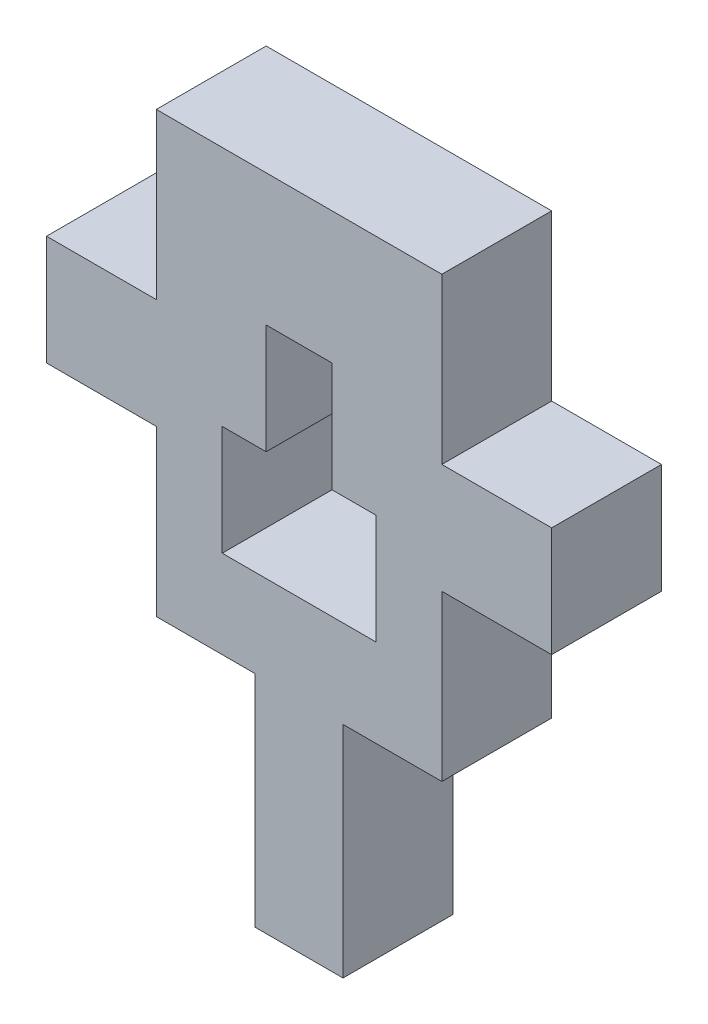
ISO-10303-21;
HEADER;
FILE_DESCRIPTION(('STEP AP214'),'2;1');
FILE_NAME('part.step','',(''),(''),'','','');
FILE_SCHEMA(('AUTOMOTIVE_DESIGN { 1 0 10303 214 1 1 1 1 }'));
ENDSEC;
DATA;
#1=APPLICATION_CONTEXT('core data for automotive mechanical design processes');
#2=APPLICATION_PROTOCOL_DEFINITION('international standard','automotive_design',2000,#1);
#3=PRODUCT_CONTEXT('',#1,'mechanical');
#4=PRODUCT('Part','Part','',(#3));
#5=PRODUCT_RELATED_PRODUCT_CATEGORY('part','',(#4));
#6=PRODUCT_DEFINITION_FORMATION('','',#4);
#7=PRODUCT_DEFINITION_CONTEXT('part definition',#1,'design');
#8=PRODUCT_DEFINITION('design','',#6,#7);
#9=PRODUCT_DEFINITION_SHAPE('','',#8);
#10=(LENGTH_UNIT() NAMED_UNIT(*) SI_UNIT(.MILLI.,.METRE.));
#11=(NAMED_UNIT(*) PLANE_ANGLE_UNIT() SI_UNIT($,.RADIAN.));
#12=(NAMED_UNIT(*) SI_UNIT($,.STERADIAN.) SOLID_ANGLE_UNIT());
#13=UNCERTAINTY_MEASURE_WITH_UNIT(LENGTH_MEASURE(1.E-05),#10,'distance_accuracy_value','');
#14=(GEOMETRIC_REPRESENTATION_CONTEXT(3) GLOBAL_UNCERTAINTY_ASSIGNED_CONTEXT((#13)) GLOBAL_UNIT_ASSIGNED_CONTEXT((#10,
#11,#12)) REPRESENTATION_CONTEXT('',''));
#15=CARTESIAN_POINT('',(0.,0.,0.));
#16=DIRECTION('',(0.,0.,1.));
#17=DIRECTION('',(1.,0.,0.));
#18=AXIS2_PLACEMENT_3D('',#15,#16,#17);
#19=CARTESIAN_POINT('',(10.,9.,10.));
#20=DIRECTION('',(0.,1.,0.));
#21=DIRECTION('',(0.,0.,1.));
#22=AXIS2_PLACEMENT_3D('',#19,#20,#21);
#23=PLANE('',#22);
#24=DIRECTION('',(-1.,0.,0.));
#25=VECTOR('',#24,1.);
#26=CARTESIAN_POINT('',(0.,9.,5.));
#27=LINE('',#26,#25);
#28=CARTESIAN_POINT('',(10.,9.,5.));
#29=VERTEX_POINT('',#28);
#30=CARTESIAN_POINT('',(8.,9.,5.));
#31=VERTEX_POINT('',#30);
#32=EDGE_CURVE('E253',#29,#31,#27,.T.);
#33=ORIENTED_EDGE('',*,*,#32,.T.);
#34=DIRECTION('',(0.,0.,-1.));
#35=VECTOR('',#34,1.);
#36=CARTESIAN_POINT('',(8.,9.,10.));
#37=LINE('',#36,#35);
#38=CARTESIAN_POINT('',(8.,9.,0.));
#39=VERTEX_POINT('',#38);
#40=EDGE_CURVE('E223',#31,#39,#37,.T.);
#41=ORIENTED_EDGE('',*,*,#40,.T.);
#42=DIRECTION('',(1.,0.,0.));
#43=VECTOR('',#42,1.);
#44=CARTESIAN_POINT('',(10.,9.,0.));
#45=LINE('',#44,#43);
#46=CARTESIAN_POINT('',(10.,9.,0.));
#47=VERTEX_POINT('',#46);
#48=EDGE_CURVE('E236',#39,#47,#45,.T.);
#49=ORIENTED_EDGE('',*,*,#48,.T.);
#50=DIRECTION('',(0.,0.,-1.));
#51=VECTOR('',#50,1.);
#52=CARTESIAN_POINT('',(10.,9.,10.));
#53=LINE('',#52,#51);
#54=EDGE_CURVE('E240',#29,#47,#53,.T.);
#55=ORIENTED_EDGE('',*,*,#54,.F.);
#56=EDGE_LOOP('',(#33,#41,#49,#55));
#57=FACE_BOUND('',#56,.T.);
#58=ADVANCED_FACE('F34',(#57),#23,.F.);
#59=CARTESIAN_POINT('',(8.5,0.,5.));
#60=DIRECTION('',(1.,0.,0.));
#61=DIRECTION('',(0.,0.,-1.));
#62=AXIS2_PLACEMENT_3D('',#59,#60,#61);
#63=PLANE('',#62);
#64=DIRECTION('',(0.,-1.,0.));
#65=VECTOR('',#64,1.);
#66=CARTESIAN_POINT('',(8.5,0.,0.));
#67=LINE('',#66,#65);
#68=CARTESIAN_POINT('',(8.5,0.,0.));
#69=VERTEX_POINT('',#68);
#70=CARTESIAN_POINT('',(8.5,-10.,0.));
#71=VERTEX_POINT('',#70);
#72=EDGE_CURVE('E258',#69,#71,#67,.T.);
#73=ORIENTED_EDGE('',*,*,#72,.F.);
#74=DIRECTION('',(0.,0.,-1.));
#75=VECTOR('',#74,1.);
#76=CARTESIAN_POINT('',(8.5,0.,5.));
#77=LINE('',#76,#75);
#78=CARTESIAN_POINT('',(8.5,0.,5.));
#79=VERTEX_POINT('',#78);
#80=EDGE_CURVE('E11',#79,#69,#77,.T.);
#81=ORIENTED_EDGE('',*,*,#80,.F.);
#82=DIRECTION('',(0.,-1.,0.));
#83=VECTOR('',#82,1.);
#84=CARTESIAN_POINT('',(8.5,0.,5.));
#85=LINE('',#84,#83);
#86=CARTESIAN_POINT('',(8.5,-10.,5.));
#87=VERTEX_POINT('',#86);
#88=EDGE_CURVE('E259',#79,#87,#85,.T.);
#89=ORIENTED_EDGE('',*,*,#88,.T.);
#90=DIRECTION('',(0.,0.,-1.));
#91=VECTOR('',#90,1.);
#92=CARTESIAN_POINT('',(8.5,-10.,5.));
#93=LINE('',#92,#91);
#94=EDGE_CURVE('E294',#87,#71,#93,.T.);
#95=ORIENTED_EDGE('',*,*,#94,.T.);
#96=EDGE_LOOP('',(#73,#81,#89,#95));
#97=FACE_BOUND('',#96,.T.);
#98=ADVANCED_FACE('F36',(#97),#63,.T.);
#99=CARTESIAN_POINT('',(0.,0.,5.));
#100=DIRECTION('',(0.,1.,0.));
#101=DIRECTION('',(0.,0.,1.));
#102=AXIS2_PLACEMENT_3D('',#99,#100,#101);
#103=PLANE('',#102);
#104=DIRECTION('',(1.,0.,0.));
#105=VECTOR('',#104,1.);
#106=CARTESIAN_POINT('',(0.,0.,0.));
#107=LINE('',#106,#105);
#108=CARTESIAN_POINT('',(13.,0.,0.));
#109=VERTEX_POINT('',#108);
#110=EDGE_CURVE('E297',#69,#109,#107,.T.);
#111=ORIENTED_EDGE('',*,*,#110,.T.);
#112=DIRECTION('',(0.,0.,-1.));
#113=VECTOR('',#112,1.);
#114=CARTESIAN_POINT('',(13.,0.,5.));
#115=LINE('',#114,#113);
#116=CARTESIAN_POINT('',(13.,0.,5.));
#117=VERTEX_POINT('',#116);
#118=EDGE_CURVE('E42',#117,#109,#115,.T.);
#119=ORIENTED_EDGE('',*,*,#118,.F.);
#120=DIRECTION('',(1.,0.,0.));
#121=VECTOR('',#120,1.);
#122=CARTESIAN_POINT('',(0.,0.,5.));
#123=LINE('',#122,#121);
#124=EDGE_CURVE('E262',#79,#117,#123,.T.);
#125=ORIENTED_EDGE('',*,*,#124,.F.);
#126=ORIENTED_EDGE('',*,*,#80,.T.);
#127=EDGE_LOOP('',(#111,#119,#125,#126));
#128=FACE_BOUND('',#127,.T.);
#129=ADVANCED_FACE('F386',(#128),#103,.F.);
#130=CARTESIAN_POINT('',(13.,0.,5.));
#131=DIRECTION('',(-1.,0.,0.));
#132=DIRECTION('',(0.,0.,1.));
#133=AXIS2_PLACEMENT_3D('',#130,#131,#132);
#134=PLANE('',#133);
#135=DIRECTION('',(0.,1.,0.));
#136=VECTOR('',#135,1.);
#137=CARTESIAN_POINT('',(13.,0.,0.));
#138=LINE('',#137,#136);
#139=CARTESIAN_POINT('',(13.,7.5,0.));
#140=VERTEX_POINT('',#139);
#141=EDGE_CURVE('E299',#109,#140,#138,.T.);
#142=ORIENTED_EDGE('',*,*,#141,.T.);
#143=DIRECTION('',(0.,0.,-1.));
#144=VECTOR('',#143,1.);
#145=CARTESIAN_POINT('',(13.,7.5,5.));
#146=LINE('',#145,#144);
#147=CARTESIAN_POINT('',(13.,7.5,5.));
#148=VERTEX_POINT('',#147);
#149=EDGE_CURVE('E359',#148,#140,#146,.T.);
#150=ORIENTED_EDGE('',*,*,#149,.F.);
#151=DIRECTION('',(0.,1.,0.));
#152=VECTOR('',#151,1.);
#153=CARTESIAN_POINT('',(13.,0.,5.));
#154=LINE('',#153,#152);
#155=EDGE_CURVE('E265',#117,#148,#154,.T.);
#156=ORIENTED_EDGE('',*,*,#155,.F.);
#157=ORIENTED_EDGE('',*,*,#118,.T.);
#158=EDGE_LOOP('',(#142,#150,#156,#157));
#159=FACE_BOUND('',#158,.T.);
#160=ADVANCED_FACE('F366',(#159),#134,.F.);
#161=CARTESIAN_POINT('',(0.,7.5,5.));
#162=DIRECTION('',(0.,1.,0.));
#163=DIRECTION('',(0.,0.,1.));
#164=AXIS2_PLACEMENT_3D('',#161,#162,#163);
#165=PLANE('',#164);
#166=DIRECTION('',(1.,0.,0.));
#167=VECTOR('',#166,1.);
#168=CARTESIAN_POINT('',(0.,7.5,0.));
#169=LINE('',#168,#167);
#170=CARTESIAN_POINT('',(18.,7.5,0.));
#171=VERTEX_POINT('',#170);
#172=EDGE_CURVE('E302',#140,#171,#169,.T.);
#173=ORIENTED_EDGE('',*,*,#172,.T.);
#174=DIRECTION('',(0.,0.,-1.));
#175=VECTOR('',#174,1.);
#176=CARTESIAN_POINT('',(18.,7.5,5.));
#177=LINE('',#176,#175);
#178=CARTESIAN_POINT('',(18.,7.5,5.));
#179=VERTEX_POINT('',#178);
#180=EDGE_CURVE('E356',#179,#171,#177,.T.);
#181=ORIENTED_EDGE('',*,*,#180,.F.);
#182=DIRECTION('',(1.,0.,0.));
#183=VECTOR('',#182,1.);
#184=CARTESIAN_POINT('',(0.,7.5,5.));
#185=LINE('',#184,#183);
#186=EDGE_CURVE('E268',#148,#179,#185,.T.);
#187=ORIENTED_EDGE('',*,*,#186,.F.);
#188=ORIENTED_EDGE('',*,*,#149,.T.);
#189=EDGE_LOOP('',(#173,#181,#187,#188));
#190=FACE_BOUND('',#189,.T.);
#191=ADVANCED_FACE('F376',(#190),#165,.F.);
#192=CARTESIAN_POINT('',(18.,0.,5.));
#193=DIRECTION('',(-1.,0.,0.));
#194=DIRECTION('',(0.,-1.,0.));
#195=AXIS2_PLACEMENT_3D('',#192,#193,#194);
#196=PLANE('',#195);
#197=DIRECTION('',(0.,1.,0.));
#198=VECTOR('',#197,1.);
#199=CARTESIAN_POINT('',(18.,0.,0.));
#200=LINE('',#199,#198);
#201=CARTESIAN_POINT('',(18.,12.5,0.));
#202=VERTEX_POINT('',#201);
#203=EDGE_CURVE('E305',#171,#202,#200,.T.);
#204=ORIENTED_EDGE('',*,*,#203,.T.);
#205=DIRECTION('',(0.,0.,-1.));
#206=VECTOR('',#205,1.);
#207=CARTESIAN_POINT('',(18.,12.5,5.));
#208=LINE('',#207,#206);
#209=CARTESIAN_POINT('',(18.,12.5,5.));
#210=VERTEX_POINT('',#209);
#211=EDGE_CURVE('E354',#210,#202,#208,.T.);
#212=ORIENTED_EDGE('',*,*,#211,.F.);
#213=DIRECTION('',(0.,1.,0.));
#214=VECTOR('',#213,1.);
#215=CARTESIAN_POINT('',(18.,0.,5.));
#216=LINE('',#215,#214);
#217=EDGE_CURVE('E271',#179,#210,#216,.T.);
#218=ORIENTED_EDGE('',*,*,#217,.F.);
#219=ORIENTED_EDGE('',*,*,#180,.T.);
#220=EDGE_LOOP('',(#204,#212,#218,#219));
#221=FACE_BOUND('',#220,.T.);
#222=ADVANCED_FACE('F380',(#221),#196,.F.);
#223=CARTESIAN_POINT('',(0.,12.5,5.));
#224=DIRECTION('',(0.,1.,0.));
#225=DIRECTION('',(0.,0.,1.));
#226=AXIS2_PLACEMENT_3D('',#223,#224,#225);
#227=PLANE('',#226);
#228=DIRECTION('',(1.,0.,0.));
#229=VECTOR('',#228,1.);
#230=CARTESIAN_POINT('',(0.,12.5,0.));
#231=LINE('',#230,#229);
#232=CARTESIAN_POINT('',(13.,12.5,0.));
#233=VERTEX_POINT('',#232);
#234=EDGE_CURVE('E308',#233,#202,#231,.T.);
#235=ORIENTED_EDGE('',*,*,#234,.F.);
#236=DIRECTION('',(0.,0.,-1.));
#237=VECTOR('',#236,1.);
#238=CARTESIAN_POINT('',(13.,12.5,5.));
#239=LINE('',#238,#237);
#240=CARTESIAN_POINT('',(13.,12.5,5.));
#241=VERTEX_POINT('',#240);
#242=EDGE_CURVE('E352',#241,#233,#239,.T.);
#243=ORIENTED_EDGE('',*,*,#242,.F.);
#244=DIRECTION('',(1.,0.,0.));
#245=VECTOR('',#244,1.);
#246=CARTESIAN_POINT('',(0.,12.5,5.));
#247=LINE('',#246,#245);
#248=EDGE_CURVE('E273',#241,#210,#247,.T.);
#249=ORIENTED_EDGE('',*,*,#248,.T.);
#250=ORIENTED_EDGE('',*,*,#211,.T.);
#251=EDGE_LOOP('',(#235,#243,#249,#250));
#252=FACE_BOUND('',#251,.T.);
#253=ADVANCED_FACE('F436',(#252),#227,.T.);
#254=CARTESIAN_POINT('',(13.,20.,0.));
#255=VERTEX_POINT('',#254);
#256=EDGE_CURVE('E303',#233,#255,#138,.T.);
#257=ORIENTED_EDGE('',*,*,#256,.T.);
#258=DIRECTION('',(0.,0.,-1.));
#259=VECTOR('',#258,1.);
#260=CARTESIAN_POINT('',(13.,20.,5.));
#261=LINE('',#260,#259);
#262=CARTESIAN_POINT('',(13.,20.,5.));
#263=VERTEX_POINT('',#262);
#264=EDGE_CURVE('E350',#263,#255,#261,.T.);
#265=ORIENTED_EDGE('',*,*,#264,.F.);
#266=EDGE_CURVE('E269',#241,#263,#154,.T.);
#267=ORIENTED_EDGE('',*,*,#266,.F.);
#268=ORIENTED_EDGE('',*,*,#242,.T.);
#269=EDGE_LOOP('',(#257,#265,#267,#268));
#270=FACE_BOUND('',#269,.T.);
#271=ADVANCED_FACE('F438',(#270),#134,.F.);
#272=CARTESIAN_POINT('',(0.,20.,5.));
#273=DIRECTION('',(0.,1.,0.));
#274=DIRECTION('',(0.,0.,1.));
#275=AXIS2_PLACEMENT_3D('',#272,#273,#274);
#276=PLANE('',#275);
#277=DIRECTION('',(1.,0.,0.));
#278=VECTOR('',#277,1.);
#279=CARTESIAN_POINT('',(0.,20.,0.));
#280=LINE('',#279,#278);
#281=CARTESIAN_POINT('',(0.,20.,0.));
#282=VERTEX_POINT('',#281);
#283=EDGE_CURVE('E311',#282,#255,#280,.T.);
#284=ORIENTED_EDGE('',*,*,#283,.F.);
#285=DIRECTION('',(0.,0.,-1.));
#286=VECTOR('',#285,1.);
#287=CARTESIAN_POINT('',(0.,20.,5.));
#288=LINE('',#287,#286);
#289=CARTESIAN_POINT('',(0.,20.,5.));
#290=VERTEX_POINT('',#289);
#291=EDGE_CURVE('E348',#290,#282,#288,.T.);
#292=ORIENTED_EDGE('',*,*,#291,.F.);
#293=DIRECTION('',(1.,0.,0.));
#294=VECTOR('',#293,1.);
#295=CARTESIAN_POINT('',(0.,20.,5.));
#296=LINE('',#295,#294);
#297=EDGE_CURVE('E276',#290,#263,#296,.T.);
#298=ORIENTED_EDGE('',*,*,#297,.T.);
#299=ORIENTED_EDGE('',*,*,#264,.T.);
#300=EDGE_LOOP('',(#284,#292,#298,#299));
#301=FACE_BOUND('',#300,.T.);
#302=ADVANCED_FACE('F429',(#301),#276,.T.);
#303=CARTESIAN_POINT('',(0.,0.,5.));
#304=DIRECTION('',(-1.,0.,0.));
#305=DIRECTION('',(0.,0.,1.));
#306=AXIS2_PLACEMENT_3D('',#303,#304,#305);
#307=PLANE('',#306);
#308=DIRECTION('',(0.,1.,0.));
#309=VECTOR('',#308,1.);
#310=CARTESIAN_POINT('',(0.,0.,0.));
#311=LINE('',#310,#309);
#312=CARTESIAN_POINT('',(0.,12.5,0.));
#313=VERTEX_POINT('',#312);
#314=EDGE_CURVE('E314',#313,#282,#311,.T.);
#315=ORIENTED_EDGE('',*,*,#314,.F.);
#316=DIRECTION('',(0.,0.,-1.));
#317=VECTOR('',#316,1.);
#318=CARTESIAN_POINT('',(0.,12.5,5.));
#319=LINE('',#318,#317);
#320=CARTESIAN_POINT('',(0.,12.5,5.));
#321=VERTEX_POINT('',#320);
#322=EDGE_CURVE('E346',#321,#313,#319,.T.);
#323=ORIENTED_EDGE('',*,*,#322,.F.);
#324=DIRECTION('',(0.,1.,0.));
#325=VECTOR('',#324,1.);
#326=CARTESIAN_POINT('',(0.,0.,5.));
#327=LINE('',#326,#325);
#328=EDGE_CURVE('E279',#321,#290,#327,.T.);
#329=ORIENTED_EDGE('',*,*,#328,.T.);
#330=ORIENTED_EDGE('',*,*,#291,.T.);
#331=EDGE_LOOP('',(#315,#323,#329,#330));
#332=FACE_BOUND('',#331,.T.);
#333=ADVANCED_FACE('F423',(#332),#307,.T.);
#334=CARTESIAN_POINT('',(0.,12.5,5.));
#335=DIRECTION('',(0.,-1.,0.));
#336=DIRECTION('',(0.,0.,-1.));
#337=AXIS2_PLACEMENT_3D('',#334,#335,#336);
#338=PLANE('',#337);
#339=DIRECTION('',(-1.,0.,0.));
#340=VECTOR('',#339,1.);
#341=CARTESIAN_POINT('',(0.,12.5,0.));
#342=LINE('',#341,#340);
#343=CARTESIAN_POINT('',(-5.,12.5,0.));
#344=VERTEX_POINT('',#343);
#345=EDGE_CURVE('E317',#313,#344,#342,.T.);
#346=ORIENTED_EDGE('',*,*,#345,.T.);
#347=DIRECTION('',(0.,0.,-1.));
#348=VECTOR('',#347,1.);
#349=CARTESIAN_POINT('',(-5.,12.5,5.));
#350=LINE('',#349,#348);
#351=CARTESIAN_POINT('',(-5.,12.5,5.));
#352=VERTEX_POINT('',#351);
#353=EDGE_CURVE('E343',#352,#344,#350,.T.);
#354=ORIENTED_EDGE('',*,*,#353,.F.);
#355=DIRECTION('',(-1.,0.,0.));
#356=VECTOR('',#355,1.);
#357=CARTESIAN_POINT('',(0.,12.5,5.));
#358=LINE('',#357,#356);
#359=EDGE_CURVE('E282',#321,#352,#358,.T.);
#360=ORIENTED_EDGE('',*,*,#359,.F.);
#361=ORIENTED_EDGE('',*,*,#322,.T.);
#362=EDGE_LOOP('',(#346,#354,#360,#361));
#363=FACE_BOUND('',#362,.T.);
#364=ADVANCED_FACE('F439',(#363),#338,.F.);
#365=CARTESIAN_POINT('',(-5.,0.,5.));
#366=DIRECTION('',(1.,0.,0.));
#367=DIRECTION('',(0.,1.,0.));
#368=AXIS2_PLACEMENT_3D('',#365,#366,#367);
#369=PLANE('',#368);
#370=DIRECTION('',(0.,-1.,0.));
#371=VECTOR('',#370,1.);
#372=CARTESIAN_POINT('',(-5.,0.,0.));
#373=LINE('',#372,#371);
#374=CARTESIAN_POINT('',(-5.,7.5,0.));
#375=VERTEX_POINT('',#374);
#376=EDGE_CURVE('E320',#344,#375,#373,.T.);
#377=ORIENTED_EDGE('',*,*,#376,.T.);
#378=DIRECTION('',(0.,0.,-1.));
#379=VECTOR('',#378,1.);
#380=CARTESIAN_POINT('',(-5.,7.5,5.));
#381=LINE('',#380,#379);
#382=CARTESIAN_POINT('',(-5.,7.5,5.));
#383=VERTEX_POINT('',#382);
#384=EDGE_CURVE('E341',#383,#375,#381,.T.);
#385=ORIENTED_EDGE('',*,*,#384,.F.);
#386=DIRECTION('',(0.,-1.,0.));
#387=VECTOR('',#386,1.);
#388=CARTESIAN_POINT('',(-5.,0.,5.));
#389=LINE('',#388,#387);
#390=EDGE_CURVE('E285',#352,#383,#389,.T.);
#391=ORIENTED_EDGE('',*,*,#390,.F.);
#392=ORIENTED_EDGE('',*,*,#353,.T.);
#393=EDGE_LOOP('',(#377,#385,#391,#392));
#394=FACE_BOUND('',#393,.T.);
#395=ADVANCED_FACE('F417',(#394),#369,.F.);
#396=CARTESIAN_POINT('',(0.,7.5,5.));
#397=DIRECTION('',(0.,-1.,0.));
#398=DIRECTION('',(1.,0.,0.));
#399=AXIS2_PLACEMENT_3D('',#396,#397,#398);
#400=PLANE('',#399);
#401=DIRECTION('',(-1.,0.,0.));
#402=VECTOR('',#401,1.);
#403=CARTESIAN_POINT('',(0.,7.5,0.));
#404=LINE('',#403,#402);
#405=CARTESIAN_POINT('',(0.,7.5,0.));
#406=VERTEX_POINT('',#405);
#407=EDGE_CURVE('E323',#406,#375,#404,.T.);
#408=ORIENTED_EDGE('',*,*,#407,.F.);
#409=DIRECTION('',(0.,0.,-1.));
#410=VECTOR('',#409,1.);
#411=CARTESIAN_POINT('',(0.,7.5,5.));
#412=LINE('',#411,#410);
#413=CARTESIAN_POINT('',(0.,7.5,5.));
#414=VERTEX_POINT('',#413);
#415=EDGE_CURVE('E339',#414,#406,#412,.T.);
#416=ORIENTED_EDGE('',*,*,#415,.F.);
#417=DIRECTION('',(-1.,0.,0.));
#418=VECTOR('',#417,1.);
#419=CARTESIAN_POINT('',(0.,7.5,5.));
#420=LINE('',#419,#418);
#421=EDGE_CURVE('E287',#414,#383,#420,.T.);
#422=ORIENTED_EDGE('',*,*,#421,.T.);
#423=ORIENTED_EDGE('',*,*,#384,.T.);
#424=EDGE_LOOP('',(#408,#416,#422,#423));
#425=FACE_BOUND('',#424,.T.);
#426=ADVANCED_FACE('F413',(#425),#400,.T.);
#427=CARTESIAN_POINT('',(0.,0.,0.));
#428=VERTEX_POINT('',#427);
#429=EDGE_CURVE('E318',#428,#406,#311,.T.);
#430=ORIENTED_EDGE('',*,*,#429,.F.);
#431=DIRECTION('',(0.,0.,-1.));
#432=VECTOR('',#431,1.);
#433=CARTESIAN_POINT('',(0.,0.,5.));
#434=LINE('',#433,#432);
#435=CARTESIAN_POINT('',(0.,0.,5.));
#436=VERTEX_POINT('',#435);
#437=EDGE_CURVE('E337',#436,#428,#434,.T.);
#438=ORIENTED_EDGE('',*,*,#437,.F.);
#439=EDGE_CURVE('E283',#436,#414,#327,.T.);
#440=ORIENTED_EDGE('',*,*,#439,.T.);
#441=ORIENTED_EDGE('',*,*,#415,.T.);
#442=EDGE_LOOP('',(#430,#438,#440,#441));
#443=FACE_BOUND('',#442,.T.);
#444=ADVANCED_FACE('F409',(#443),#307,.T.);
#445=CARTESIAN_POINT('',(4.5,0.,0.));
#446=VERTEX_POINT('',#445);
#447=EDGE_CURVE('E300',#428,#446,#107,.T.);
#448=ORIENTED_EDGE('',*,*,#447,.T.);
#449=DIRECTION('',(0.,0.,-1.));
#450=VECTOR('',#449,1.);
#451=CARTESIAN_POINT('',(4.5,0.,5.));
#452=LINE('',#451,#450);
#453=CARTESIAN_POINT('',(4.5,0.,5.));
#454=VERTEX_POINT('',#453);
#455=EDGE_CURVE('E334',#454,#446,#452,.T.);
#456=ORIENTED_EDGE('',*,*,#455,.F.);
#457=EDGE_CURVE('E266',#436,#454,#123,.T.);
#458=ORIENTED_EDGE('',*,*,#457,.F.);
#459=ORIENTED_EDGE('',*,*,#437,.T.);
#460=EDGE_LOOP('',(#448,#456,#458,#459));
#461=FACE_BOUND('',#460,.T.);
#462=ADVANCED_FACE('F402',(#461),#103,.F.);
#463=CARTESIAN_POINT('',(4.5,0.,5.));
#464=DIRECTION('',(1.,0.,0.));
#465=DIRECTION('',(0.,0.,-1.));
#466=AXIS2_PLACEMENT_3D('',#463,#464,#465);
#467=PLANE('',#466);
#468=DIRECTION('',(0.,-1.,0.));
#469=VECTOR('',#468,1.);
#470=CARTESIAN_POINT('',(4.5,0.,0.));
#471=LINE('',#470,#469);
#472=CARTESIAN_POINT('',(4.5,-10.,0.));
#473=VERTEX_POINT('',#472);
#474=EDGE_CURVE('E326',#446,#473,#471,.T.);
#475=ORIENTED_EDGE('',*,*,#474,.T.);
#476=DIRECTION('',(0.,0.,-1.));
#477=VECTOR('',#476,1.);
#478=CARTESIAN_POINT('',(4.5,-10.,5.));
#479=LINE('',#478,#477);
#480=CARTESIAN_POINT('',(4.5,-10.,5.));
#481=VERTEX_POINT('',#480);
#482=EDGE_CURVE('E331',#481,#473,#479,.T.);
#483=ORIENTED_EDGE('',*,*,#482,.F.);
#484=DIRECTION('',(0.,-1.,0.));
#485=VECTOR('',#484,1.);
#486=CARTESIAN_POINT('',(4.5,0.,5.));
#487=LINE('',#486,#485);
#488=EDGE_CURVE('E290',#454,#481,#487,.T.);
#489=ORIENTED_EDGE('',*,*,#488,.F.);
#490=ORIENTED_EDGE('',*,*,#455,.T.);
#491=EDGE_LOOP('',(#475,#483,#489,#490));
#492=FACE_BOUND('',#491,.T.);
#493=ADVANCED_FACE('F398',(#492),#467,.F.);
#494=CARTESIAN_POINT('',(0.,-10.,5.));
#495=DIRECTION('',(0.,1.,0.));
#496=DIRECTION('',(0.,0.,1.));
#497=AXIS2_PLACEMENT_3D('',#494,#495,#496);
#498=PLANE('',#497);
#499=DIRECTION('',(1.,0.,0.));
#500=VECTOR('',#499,1.);
#501=CARTESIAN_POINT('',(0.,-10.,0.));
#502=LINE('',#501,#500);
#503=EDGE_CURVE('E263',#473,#71,#502,.T.);
#504=ORIENTED_EDGE('',*,*,#503,.T.);
#505=ORIENTED_EDGE('',*,*,#94,.F.);
#506=DIRECTION('',(1.,0.,0.));
#507=VECTOR('',#506,1.);
#508=CARTESIAN_POINT('',(0.,-10.,5.));
#509=LINE('',#508,#507);
#510=EDGE_CURVE('E292',#481,#87,#509,.T.);
#511=ORIENTED_EDGE('',*,*,#510,.F.);
#512=ORIENTED_EDGE('',*,*,#482,.T.);
#513=EDGE_LOOP('',(#504,#505,#511,#512));
#514=FACE_BOUND('',#513,.T.);
#515=ADVANCED_FACE('F393',(#514),#498,.F.);
#516=CARTESIAN_POINT('',(0.,0.,5.));
#517=DIRECTION('',(0.,0.,1.));
#518=DIRECTION('',(1.,0.,0.));
#519=AXIS2_PLACEMENT_3D('',#516,#517,#518);
#520=PLANE('',#519);
#521=DIRECTION('',(0.,1.,0.));
#522=VECTOR('',#521,1.);
#523=CARTESIAN_POINT('',(8.,0.,5.));
#524=LINE('',#523,#522);
#525=CARTESIAN_POINT('',(8.,14.,5.));
#526=VERTEX_POINT('',#525);
#527=EDGE_CURVE('E226',#31,#526,#524,.T.);
#528=ORIENTED_EDGE('',*,*,#527,.F.);
#529=ORIENTED_EDGE('',*,*,#32,.F.);
#530=DIRECTION('',(0.,1.,0.));
#531=VECTOR('',#530,1.);
#532=CARTESIAN_POINT('',(10.,0.,5.));
#533=LINE('',#532,#531);
#534=CARTESIAN_POINT('',(10.,4.,5.));
#535=VERTEX_POINT('',#534);
#536=EDGE_CURVE('E256',#535,#29,#533,.T.);
#537=ORIENTED_EDGE('',*,*,#536,.F.);
#538=DIRECTION('',(1.,0.,0.));
#539=VECTOR('',#538,1.);
#540=CARTESIAN_POINT('',(0.,4.,5.));
#541=LINE('',#540,#539);
#542=CARTESIAN_POINT('',(3.,4.,5.));
#543=VERTEX_POINT('',#542);
#544=EDGE_CURVE('E243',#543,#535,#541,.T.);
#545=ORIENTED_EDGE('',*,*,#544,.F.);
#546=DIRECTION('',(0.,-1.,0.));
#547=VECTOR('',#546,1.);
#548=CARTESIAN_POINT('',(3.,0.,5.));
#549=LINE('',#548,#547);
#550=CARTESIAN_POINT('',(3.,9.,5.));
#551=VERTEX_POINT('',#550);
#552=EDGE_CURVE('E250',#551,#543,#549,.T.);
#553=ORIENTED_EDGE('',*,*,#552,.F.);
#554=CARTESIAN_POINT('',(5.,9.,5.));
#555=VERTEX_POINT('',#554);
#556=EDGE_CURVE('E252',#555,#551,#27,.T.);
#557=ORIENTED_EDGE('',*,*,#556,.F.);
#558=DIRECTION('',(0.,-1.,0.));
#559=VECTOR('',#558,1.);
#560=CARTESIAN_POINT('',(5.,0.,5.));
#561=LINE('',#560,#559);
#562=CARTESIAN_POINT('',(5.,14.,5.));
#563=VERTEX_POINT('',#562);
#564=EDGE_CURVE('E49',#563,#555,#561,.T.);
#565=ORIENTED_EDGE('',*,*,#564,.F.);
#566=DIRECTION('',(-1.,0.,0.));
#567=VECTOR('',#566,1.);
#568=CARTESIAN_POINT('',(0.,14.,5.));
#569=LINE('',#568,#567);
#570=EDGE_CURVE('E202',#526,#563,#569,.T.);
#571=ORIENTED_EDGE('',*,*,#570,.F.);
#572=EDGE_LOOP('',(#528,#529,#537,#545,#553,#557,#565,#571));
#573=FACE_BOUND('',#572,.T.);
#574=ORIENTED_EDGE('',*,*,#88,.F.);
#575=ORIENTED_EDGE('',*,*,#124,.T.);
#576=ORIENTED_EDGE('',*,*,#155,.T.);
#577=ORIENTED_EDGE('',*,*,#186,.T.);
#578=ORIENTED_EDGE('',*,*,#217,.T.);
#579=ORIENTED_EDGE('',*,*,#248,.F.);
#580=ORIENTED_EDGE('',*,*,#266,.T.);
#581=ORIENTED_EDGE('',*,*,#297,.F.);
#582=ORIENTED_EDGE('',*,*,#328,.F.);
#583=ORIENTED_EDGE('',*,*,#359,.T.);
#584=ORIENTED_EDGE('',*,*,#390,.T.);
#585=ORIENTED_EDGE('',*,*,#421,.F.);
#586=ORIENTED_EDGE('',*,*,#439,.F.);
#587=ORIENTED_EDGE('',*,*,#457,.T.);
#588=ORIENTED_EDGE('',*,*,#488,.T.);
#589=ORIENTED_EDGE('',*,*,#510,.T.);
#590=EDGE_LOOP('',(#574,#575,#576,#577,#578,#579,#580,#581,#582,#583,#584,#585,#586,#587,#588,#589));
#591=FACE_BOUND('',#590,.T.);
#592=ADVANCED_FACE('F385',(#573,#591),#520,.T.);
#593=CARTESIAN_POINT('',(0.,0.,0.));
#594=DIRECTION('',(0.,0.,1.));
#595=DIRECTION('',(1.,0.,0.));
#596=AXIS2_PLACEMENT_3D('',#593,#594,#595);
#597=PLANE('',#596);
#598=ORIENTED_EDGE('',*,*,#48,.F.);
#599=DIRECTION('',(0.,-1.,0.));
#600=VECTOR('',#599,1.);
#601=CARTESIAN_POINT('',(8.,4.,0.));
#602=LINE('',#601,#600);
#603=CARTESIAN_POINT('',(8.,14.,0.));
#604=VERTEX_POINT('',#603);
#605=EDGE_CURVE('E212',#604,#39,#602,.T.);
#606=ORIENTED_EDGE('',*,*,#605,.F.);
#607=DIRECTION('',(1.,0.,0.));
#608=VECTOR('',#607,1.);
#609=CARTESIAN_POINT('',(8.,14.,0.));
#610=LINE('',#609,#608);
#611=CARTESIAN_POINT('',(5.,14.,0.));
#612=VERTEX_POINT('',#611);
#613=EDGE_CURVE('E199',#612,#604,#610,.T.);
#614=ORIENTED_EDGE('',*,*,#613,.F.);
#615=DIRECTION('',(0.,1.,0.));
#616=VECTOR('',#615,1.);
#617=CARTESIAN_POINT('',(5.,4.,0.));
#618=LINE('',#617,#616);
#619=CARTESIAN_POINT('',(5.,9.,0.));
#620=VERTEX_POINT('',#619);
#621=EDGE_CURVE('E206',#620,#612,#618,.T.);
#622=ORIENTED_EDGE('',*,*,#621,.F.);
#623=CARTESIAN_POINT('',(3.,9.,0.));
#624=VERTEX_POINT('',#623);
#625=EDGE_CURVE('E237',#624,#620,#45,.T.);
#626=ORIENTED_EDGE('',*,*,#625,.F.);
#627=DIRECTION('',(0.,1.,0.));
#628=VECTOR('',#627,1.);
#629=CARTESIAN_POINT('',(3.,4.,0.));
#630=LINE('',#629,#628);
#631=CARTESIAN_POINT('',(3.,4.,0.));
#632=VERTEX_POINT('',#631);
#633=EDGE_CURVE('E233',#632,#624,#630,.T.);
#634=ORIENTED_EDGE('',*,*,#633,.F.);
#635=DIRECTION('',(-1.,0.,0.));
#636=VECTOR('',#635,1.);
#637=CARTESIAN_POINT('',(10.,4.,0.));
#638=LINE('',#637,#636);
#639=CARTESIAN_POINT('',(10.,4.,0.));
#640=VERTEX_POINT('',#639);
#641=EDGE_CURVE('E231',#640,#632,#638,.T.);
#642=ORIENTED_EDGE('',*,*,#641,.F.);
#643=DIRECTION('',(0.,-1.,0.));
#644=VECTOR('',#643,1.);
#645=CARTESIAN_POINT('',(10.,4.,0.));
#646=LINE('',#645,#644);
#647=EDGE_CURVE('E229',#47,#640,#646,.T.);
#648=ORIENTED_EDGE('',*,*,#647,.F.);
#649=EDGE_LOOP('',(#598,#606,#614,#622,#626,#634,#642,#648));
#650=FACE_BOUND('',#649,.T.);
#651=ORIENTED_EDGE('',*,*,#72,.T.);
#652=ORIENTED_EDGE('',*,*,#503,.F.);
#653=ORIENTED_EDGE('',*,*,#474,.F.);
#654=ORIENTED_EDGE('',*,*,#447,.F.);
#655=ORIENTED_EDGE('',*,*,#429,.T.);
#656=ORIENTED_EDGE('',*,*,#407,.T.);
#657=ORIENTED_EDGE('',*,*,#376,.F.);
#658=ORIENTED_EDGE('',*,*,#345,.F.);
#659=ORIENTED_EDGE('',*,*,#314,.T.);
#660=ORIENTED_EDGE('',*,*,#283,.T.);
#661=ORIENTED_EDGE('',*,*,#256,.F.);
#662=ORIENTED_EDGE('',*,*,#234,.T.);
#663=ORIENTED_EDGE('',*,*,#203,.F.);
#664=ORIENTED_EDGE('',*,*,#172,.F.);
#665=ORIENTED_EDGE('',*,*,#141,.F.);
#666=ORIENTED_EDGE('',*,*,#110,.F.);
#667=EDGE_LOOP('',(#651,#652,#653,#654,#655,#656,#657,#658,#659,#660,#661,#662,#663,#664,#665,#666));
#668=FACE_BOUND('',#667,.T.);
#669=ADVANCED_FACE('F215',(#650,#668),#597,.F.);
#670=CARTESIAN_POINT('',(10.,4.,10.));
#671=DIRECTION('',(1.,0.,0.));
#672=DIRECTION('',(0.,0.,-1.));
#673=AXIS2_PLACEMENT_3D('',#670,#671,#672);
#674=PLANE('',#673);
#675=ORIENTED_EDGE('',*,*,#536,.T.);
#676=ORIENTED_EDGE('',*,*,#54,.T.);
#677=ORIENTED_EDGE('',*,*,#647,.T.);
#678=DIRECTION('',(0.,0.,-1.));
#679=VECTOR('',#678,1.);
#680=CARTESIAN_POINT('',(10.,4.,10.));
#681=LINE('',#680,#679);
#682=EDGE_CURVE('E239',#535,#640,#681,.T.);
#683=ORIENTED_EDGE('',*,*,#682,.F.);
#684=EDGE_LOOP('',(#675,#676,#677,#683));
#685=FACE_BOUND('',#684,.T.);
#686=ADVANCED_FACE('F462',(#685),#674,.F.);
#687=ORIENTED_EDGE('',*,*,#625,.T.);
#688=DIRECTION('',(0.,0.,1.));
#689=VECTOR('',#688,1.);
#690=CARTESIAN_POINT('',(5.,9.,10.));
#691=LINE('',#690,#689);
#692=EDGE_CURVE('E208',#620,#555,#691,.T.);
#693=ORIENTED_EDGE('',*,*,#692,.T.);
#694=ORIENTED_EDGE('',*,*,#556,.T.);
#695=DIRECTION('',(0.,0.,-1.));
#696=VECTOR('',#695,1.);
#697=CARTESIAN_POINT('',(3.,9.,10.));
#698=LINE('',#697,#696);
#699=EDGE_CURVE('E244',#551,#624,#698,.T.);
#700=ORIENTED_EDGE('',*,*,#699,.T.);
#701=EDGE_LOOP('',(#687,#693,#694,#700));
#702=FACE_BOUND('',#701,.T.);
#703=ADVANCED_FACE('F452',(#702),#23,.F.);
#704=CARTESIAN_POINT('',(3.,4.,10.));
#705=DIRECTION('',(-1.,0.,0.));
#706=DIRECTION('',(0.,0.,1.));
#707=AXIS2_PLACEMENT_3D('',#704,#705,#706);
#708=PLANE('',#707);
#709=ORIENTED_EDGE('',*,*,#552,.T.);
#710=DIRECTION('',(0.,0.,-1.));
#711=VECTOR('',#710,1.);
#712=CARTESIAN_POINT('',(3.,4.,10.));
#713=LINE('',#712,#711);
#714=EDGE_CURVE('E57',#543,#632,#713,.T.);
#715=ORIENTED_EDGE('',*,*,#714,.T.);
#716=ORIENTED_EDGE('',*,*,#633,.T.);
#717=ORIENTED_EDGE('',*,*,#699,.F.);
#718=EDGE_LOOP('',(#709,#715,#716,#717));
#719=FACE_BOUND('',#718,.T.);
#720=ADVANCED_FACE('F461',(#719),#708,.F.);
#721=CARTESIAN_POINT('',(10.,4.,10.));
#722=DIRECTION('',(0.,-1.,0.));
#723=DIRECTION('',(1.,0.,0.));
#724=AXIS2_PLACEMENT_3D('',#721,#722,#723);
#725=PLANE('',#724);
#726=ORIENTED_EDGE('',*,*,#544,.T.);
#727=ORIENTED_EDGE('',*,*,#682,.T.);
#728=ORIENTED_EDGE('',*,*,#641,.T.);
#729=ORIENTED_EDGE('',*,*,#714,.F.);
#730=EDGE_LOOP('',(#726,#727,#728,#729));
#731=FACE_BOUND('',#730,.T.);
#732=ADVANCED_FACE('F469',(#731),#725,.F.);
#733=CARTESIAN_POINT('',(8.,4.,10.));
#734=DIRECTION('',(1.,0.,0.));
#735=DIRECTION('',(0.,0.,-1.));
#736=AXIS2_PLACEMENT_3D('',#733,#734,#735);
#737=PLANE('',#736);
#738=ORIENTED_EDGE('',*,*,#527,.T.);
#739=DIRECTION('',(0.,0.,-1.));
#740=VECTOR('',#739,1.);
#741=CARTESIAN_POINT('',(8.,14.,10.));
#742=LINE('',#741,#740);
#743=EDGE_CURVE('E203',#526,#604,#742,.T.);
#744=ORIENTED_EDGE('',*,*,#743,.T.);
#745=ORIENTED_EDGE('',*,*,#605,.T.);
#746=ORIENTED_EDGE('',*,*,#40,.F.);
#747=EDGE_LOOP('',(#738,#744,#745,#746));
#748=FACE_BOUND('',#747,.T.);
#749=ADVANCED_FACE('F488',(#748),#737,.F.);
#750=CARTESIAN_POINT('',(8.,14.,10.));
#751=DIRECTION('',(0.,1.,0.));
#752=DIRECTION('',(0.,0.,1.));
#753=AXIS2_PLACEMENT_3D('',#750,#751,#752);
#754=PLANE('',#753);
#755=ORIENTED_EDGE('',*,*,#570,.T.);
#756=DIRECTION('',(0.,0.,-1.));
#757=VECTOR('',#756,1.);
#758=CARTESIAN_POINT('',(5.,14.,10.));
#759=LINE('',#758,#757);
#760=EDGE_CURVE('E194',#563,#612,#759,.T.);
#761=ORIENTED_EDGE('',*,*,#760,.T.);
#762=ORIENTED_EDGE('',*,*,#613,.T.);
#763=ORIENTED_EDGE('',*,*,#743,.F.);
#764=EDGE_LOOP('',(#755,#761,#762,#763));
#765=FACE_BOUND('',#764,.T.);
#766=ADVANCED_FACE('F196',(#765),#754,.F.);
#767=CARTESIAN_POINT('',(5.,4.,10.));
#768=DIRECTION('',(-1.,0.,0.));
#769=DIRECTION('',(0.,0.,1.));
#770=AXIS2_PLACEMENT_3D('',#767,#768,#769);
#771=PLANE('',#770);
#772=ORIENTED_EDGE('',*,*,#564,.T.);
#773=ORIENTED_EDGE('',*,*,#692,.F.);
#774=ORIENTED_EDGE('',*,*,#621,.T.);
#775=ORIENTED_EDGE('',*,*,#760,.F.);
#776=EDGE_LOOP('',(#772,#773,#774,#775));
#777=FACE_BOUND('',#776,.T.);
#778=ADVANCED_FACE('F207',(#777),#771,.F.);
#779=CLOSED_SHELL('',(#58,#98,#129,#160,#191,#222,#253,#271,#302,#333,#364,#395,#426,#444,#462,
#493,#515,#592,#669,#686,#703,#720,#732,#749,#766,#778));
#780=MANIFOLD_SOLID_BREP('B2',#779);
#781=ADVANCED_BREP_SHAPE_REPRESENTATION('',(#18,#780),#14);
#782=SHAPE_DEFINITION_REPRESENTATION(#9,#781);
ENDSEC;
END-ISO-10303-21;
